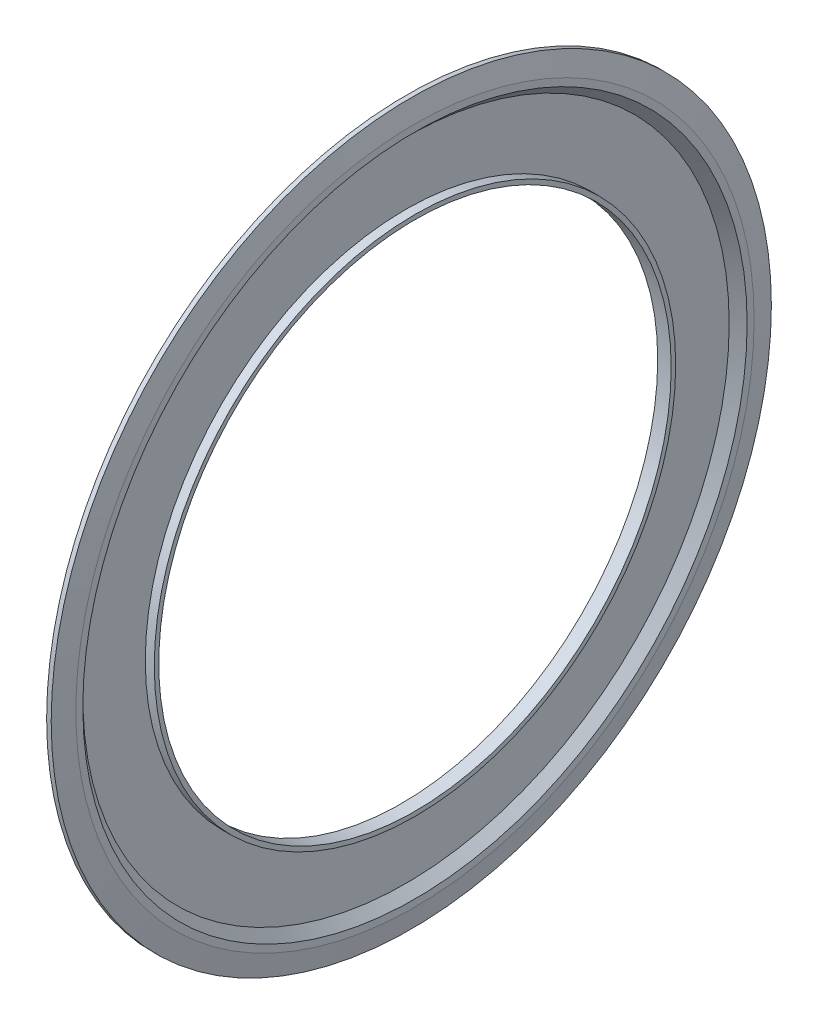
ISO-10303-21;
HEADER;
FILE_DESCRIPTION(('STEP AP214'),'2;1');
FILE_NAME('part.step','',(''),(''),'','','');
FILE_SCHEMA(('AUTOMOTIVE_DESIGN { 1 0 10303 214 1 1 1 1 }'));
ENDSEC;
DATA;
#1=APPLICATION_CONTEXT('core data for automotive mechanical design processes');
#2=APPLICATION_PROTOCOL_DEFINITION('international standard','automotive_design',2000,#1);
#3=PRODUCT_CONTEXT('',#1,'mechanical');
#4=PRODUCT('Part','Part','',(#3));
#5=PRODUCT_RELATED_PRODUCT_CATEGORY('part','',(#4));
#6=PRODUCT_DEFINITION_FORMATION('','',#4);
#7=PRODUCT_DEFINITION_CONTEXT('part definition',#1,'design');
#8=PRODUCT_DEFINITION('design','',#6,#7);
#9=PRODUCT_DEFINITION_SHAPE('','',#8);
#10=(LENGTH_UNIT() NAMED_UNIT(*) SI_UNIT(.MILLI.,.METRE.));
#11=(NAMED_UNIT(*) PLANE_ANGLE_UNIT() SI_UNIT($,.RADIAN.));
#12=(NAMED_UNIT(*) SI_UNIT($,.STERADIAN.) SOLID_ANGLE_UNIT());
#13=UNCERTAINTY_MEASURE_WITH_UNIT(LENGTH_MEASURE(1.E-05),#10,'distance_accuracy_value','');
#14=(GEOMETRIC_REPRESENTATION_CONTEXT(3) GLOBAL_UNCERTAINTY_ASSIGNED_CONTEXT((#13)) GLOBAL_UNIT_ASSIGNED_CONTEXT((#10,
#11,#12)) REPRESENTATION_CONTEXT('',''));
#15=CARTESIAN_POINT('',(0.,0.,0.));
#16=DIRECTION('',(0.,0.,1.));
#17=DIRECTION('',(1.,0.,0.));
#18=AXIS2_PLACEMENT_3D('',#15,#16,#17);
#19=CARTESIAN_POINT('',(0.352094453300078,0.,0.));
#20=DIRECTION('',(-1.,0.,0.));
#21=DIRECTION('',(0.,0.,1.));
#22=AXIS2_PLACEMENT_3D('',#19,#20,#21);
#23=CONICAL_SURFACE('',#22,6.8,1.39626340159546);
#24=CARTESIAN_POINT('',(0.278037121402523,0.,0.));
#25=DIRECTION('',(1.,0.,0.));
#26=DIRECTION('',(0.,0.,-1.));
#27=AXIS2_PLACEMENT_3D('',#24,#25,#26);
#28=CIRCLE('',#27,7.22);
#29=CARTESIAN_POINT('',(0.278037121402524,0.,-7.22));
#30=VERTEX_POINT('',#29);
#31=EDGE_CURVE('E71',#30,#30,#28,.T.);
#32=ORIENTED_EDGE('',*,*,#31,.T.);
#33=EDGE_LOOP('',(#32));
#34=FACE_BOUND('',#33,.T.);
#35=CARTESIAN_POINT('',(0.352094453300078,0.,0.));
#36=DIRECTION('',(1.,0.,0.));
#37=DIRECTION('',(0.,0.,-1.));
#38=AXIS2_PLACEMENT_3D('',#35,#36,#37);
#39=CIRCLE('',#38,6.8);
#40=CARTESIAN_POINT('',(0.352094453300079,0.,-6.8));
#41=VERTEX_POINT('',#40);
#42=EDGE_CURVE('E10',#41,#41,#39,.T.);
#43=ORIENTED_EDGE('',*,*,#42,.F.);
#44=EDGE_LOOP('',(#43));
#45=FACE_BOUND('',#44,.T.);
#46=ADVANCED_FACE('F14',(#34,#45),#23,.T.);
#47=CARTESIAN_POINT('',(0.352094453300078,6.8,0.));
#48=DIRECTION('',(-1.,0.,0.));
#49=DIRECTION('',(0.,0.,1.));
#50=AXIS2_PLACEMENT_3D('',#47,#48,#49);
#51=PLANE('',#50);
#52=CARTESIAN_POINT('',(0.352094453300078,0.,0.));
#53=DIRECTION('',(1.,0.,0.));
#54=DIRECTION('',(0.,0.,-1.));
#55=AXIS2_PLACEMENT_3D('',#52,#53,#54);
#56=CIRCLE('',#55,6.66);
#57=CARTESIAN_POINT('',(0.352094453300079,0.,-6.66));
#58=VERTEX_POINT('',#57);
#59=EDGE_CURVE('E21',#58,#58,#56,.T.);
#60=ORIENTED_EDGE('',*,*,#59,.F.);
#61=EDGE_LOOP('',(#60));
#62=FACE_BOUND('',#61,.T.);
#63=ORIENTED_EDGE('',*,*,#42,.T.);
#64=EDGE_LOOP('',(#63));
#65=FACE_BOUND('',#64,.T.);
#66=ADVANCED_FACE('F92',(#62,#65),#51,.F.);
#67=CARTESIAN_POINT('',(0.172094453300078,0.,0.));
#68=DIRECTION('',(1.,0.,0.));
#69=DIRECTION('',(0.,0.,-1.));
#70=AXIS2_PLACEMENT_3D('',#67,#68,#69);
#71=CONICAL_SURFACE('',#70,6.48,0.785398163397446);
#72=ORIENTED_EDGE('',*,*,#59,.T.);
#73=EDGE_LOOP('',(#72));
#74=FACE_BOUND('',#73,.T.);
#75=CARTESIAN_POINT('',(0.172094453300078,0.,0.));
#76=DIRECTION('',(1.,0.,0.));
#77=DIRECTION('',(0.,0.,-1.));
#78=AXIS2_PLACEMENT_3D('',#75,#76,#77);
#79=CIRCLE('',#78,6.48);
#80=CARTESIAN_POINT('',(0.172094453300079,0.,-6.48));
#81=VERTEX_POINT('',#80);
#82=EDGE_CURVE('E30',#81,#81,#79,.T.);
#83=ORIENTED_EDGE('',*,*,#82,.F.);
#84=EDGE_LOOP('',(#83));
#85=FACE_BOUND('',#84,.T.);
#86=ADVANCED_FACE('F96',(#74,#85),#71,.F.);
#87=CARTESIAN_POINT('',(0.172094453300078,5.2275,0.));
#88=DIRECTION('',(1.,0.,0.));
#89=DIRECTION('',(0.,0.,-1.));
#90=AXIS2_PLACEMENT_3D('',#87,#88,#89);
#91=PLANE('',#90);
#92=ORIENTED_EDGE('',*,*,#82,.T.);
#93=EDGE_LOOP('',(#92));
#94=FACE_BOUND('',#93,.T.);
#95=CARTESIAN_POINT('',(0.172094453300078,0.,0.));
#96=DIRECTION('',(1.,0.,0.));
#97=DIRECTION('',(0.,0.,-1.));
#98=AXIS2_PLACEMENT_3D('',#95,#96,#97);
#99=CIRCLE('',#98,5.2275);
#100=CARTESIAN_POINT('',(0.172094453300079,0.,-5.2275));
#101=VERTEX_POINT('',#100);
#102=EDGE_CURVE('E37',#101,#101,#99,.T.);
#103=ORIENTED_EDGE('',*,*,#102,.F.);
#104=EDGE_LOOP('',(#103));
#105=FACE_BOUND('',#104,.T.);
#106=ADVANCED_FACE('F101',(#94,#105),#91,.T.);
#107=CARTESIAN_POINT('',(0.352094453300078,0.,0.));
#108=DIRECTION('',(1.,0.,0.));
#109=DIRECTION('',(0.,0.,-1.));
#110=AXIS2_PLACEMENT_3D('',#107,#108,#109);
#111=CYLINDRICAL_SURFACE('',#110,5.2275);
#112=ORIENTED_EDGE('',*,*,#102,.T.);
#113=EDGE_LOOP('',(#112));
#114=FACE_BOUND('',#113,.T.);
#115=CARTESIAN_POINT('',(0.352094453300078,0.,0.));
#116=DIRECTION('',(1.,0.,0.));
#117=DIRECTION('',(0.,0.,-1.));
#118=AXIS2_PLACEMENT_3D('',#115,#116,#117);
#119=CIRCLE('',#118,5.2275);
#120=CARTESIAN_POINT('',(0.352094453300079,0.,-5.2275));
#121=VERTEX_POINT('',#120);
#122=EDGE_CURVE('E43',#121,#121,#119,.T.);
#123=ORIENTED_EDGE('',*,*,#122,.F.);
#124=EDGE_LOOP('',(#123));
#125=FACE_BOUND('',#124,.T.);
#126=ADVANCED_FACE('F106',(#114,#125),#111,.T.);
#127=CARTESIAN_POINT('',(0.352094453300078,5.1375,0.));
#128=DIRECTION('',(1.,0.,0.));
#129=DIRECTION('',(0.,0.,-1.));
#130=AXIS2_PLACEMENT_3D('',#127,#128,#129);
#131=PLANE('',#130);
#132=ORIENTED_EDGE('',*,*,#122,.T.);
#133=EDGE_LOOP('',(#132));
#134=FACE_BOUND('',#133,.T.);
#135=CARTESIAN_POINT('',(0.352094453300078,0.,0.));
#136=DIRECTION('',(1.,0.,0.));
#137=DIRECTION('',(0.,0.,-1.));
#138=AXIS2_PLACEMENT_3D('',#135,#136,#137);
#139=CIRCLE('',#138,5.1375);
#140=CARTESIAN_POINT('',(0.352094453300079,0.,-5.1375));
#141=VERTEX_POINT('',#140);
#142=EDGE_CURVE('E47',#141,#141,#139,.T.);
#143=ORIENTED_EDGE('',*,*,#142,.F.);
#144=EDGE_LOOP('',(#143));
#145=FACE_BOUND('',#144,.T.);
#146=ADVANCED_FACE('F110',(#134,#145),#131,.T.);
#147=CARTESIAN_POINT('',(0.352094453300078,0.,0.));
#148=DIRECTION('',(1.,0.,0.));
#149=DIRECTION('',(0.,0.,-1.));
#150=AXIS2_PLACEMENT_3D('',#147,#148,#149);
#151=CYLINDRICAL_SURFACE('',#150,5.1375);
#152=CARTESIAN_POINT('',(0.0820944533000784,0.,0.));
#153=DIRECTION('',(1.,0.,0.));
#154=DIRECTION('',(0.,0.,-1.));
#155=AXIS2_PLACEMENT_3D('',#152,#153,#154);
#156=CIRCLE('',#155,5.1375);
#157=CARTESIAN_POINT('',(0.082094453300079,0.,-5.1375));
#158=VERTEX_POINT('',#157);
#159=EDGE_CURVE('E51',#158,#158,#156,.T.);
#160=ORIENTED_EDGE('',*,*,#159,.F.);
#161=EDGE_LOOP('',(#160));
#162=FACE_BOUND('',#161,.T.);
#163=ORIENTED_EDGE('',*,*,#142,.T.);
#164=EDGE_LOOP('',(#163));
#165=FACE_BOUND('',#164,.T.);
#166=ADVANCED_FACE('F114',(#162,#165),#151,.F.);
#167=CARTESIAN_POINT('',(0.0820944533000784,5.1375,0.));
#168=DIRECTION('',(1.,0.,0.));
#169=DIRECTION('',(0.,0.,-1.));
#170=AXIS2_PLACEMENT_3D('',#167,#168,#169);
#171=PLANE('',#170);
#172=CARTESIAN_POINT('',(0.0820944533000784,0.,0.));
#173=DIRECTION('',(1.,0.,0.));
#174=DIRECTION('',(0.,0.,-1.));
#175=AXIS2_PLACEMENT_3D('',#172,#173,#174);
#176=CIRCLE('',#175,6.51727922061358);
#177=CARTESIAN_POINT('',(0.0820944533000792,0.,-6.51727922061358));
#178=VERTEX_POINT('',#177);
#179=EDGE_CURVE('E55',#178,#178,#176,.T.);
#180=ORIENTED_EDGE('',*,*,#179,.F.);
#181=EDGE_LOOP('',(#180));
#182=FACE_BOUND('',#181,.T.);
#183=ORIENTED_EDGE('',*,*,#159,.T.);
#184=EDGE_LOOP('',(#183));
#185=FACE_BOUND('',#184,.T.);
#186=ADVANCED_FACE('F118',(#182,#185),#171,.F.);
#187=CARTESIAN_POINT('',(0.0820944533000784,0.,0.));
#188=DIRECTION('',(1.,0.,0.));
#189=DIRECTION('',(0.,0.,-1.));
#190=AXIS2_PLACEMENT_3D('',#187,#188,#189);
#191=CONICAL_SURFACE('',#190,6.51727922061358,0.785398163397443);
#192=CARTESIAN_POINT('',(0.262094453300078,0.,0.));
#193=DIRECTION('',(1.,0.,0.));
#194=DIRECTION('',(0.,0.,-1.));
#195=AXIS2_PLACEMENT_3D('',#192,#193,#194);
#196=CIRCLE('',#195,6.69727922061358);
#197=CARTESIAN_POINT('',(0.262094453300079,0.,-6.69727922061358));
#198=VERTEX_POINT('',#197);
#199=EDGE_CURVE('E59',#198,#198,#196,.T.);
#200=ORIENTED_EDGE('',*,*,#199,.F.);
#201=EDGE_LOOP('',(#200));
#202=FACE_BOUND('',#201,.T.);
#203=ORIENTED_EDGE('',*,*,#179,.T.);
#204=EDGE_LOOP('',(#203));
#205=FACE_BOUND('',#204,.T.);
#206=ADVANCED_FACE('F122',(#202,#205),#191,.T.);
#207=CARTESIAN_POINT('',(0.262094453300078,6.69727922061358,0.));
#208=DIRECTION('',(1.,0.,0.));
#209=DIRECTION('',(0.,0.,-1.));
#210=AXIS2_PLACEMENT_3D('',#207,#208,#209);
#211=PLANE('',#210);
#212=CARTESIAN_POINT('',(0.262094453300078,0.,0.));
#213=DIRECTION('',(1.,0.,0.));
#214=DIRECTION('',(0.,0.,-1.));
#215=AXIS2_PLACEMENT_3D('',#212,#213,#214);
#216=CIRCLE('',#215,6.79212602028267);
#217=CARTESIAN_POINT('',(0.262094453300079,0.,-6.79212602028267));
#218=VERTEX_POINT('',#217);
#219=EDGE_CURVE('E63',#218,#218,#216,.T.);
#220=ORIENTED_EDGE('',*,*,#219,.F.);
#221=EDGE_LOOP('',(#220));
#222=FACE_BOUND('',#221,.T.);
#223=ORIENTED_EDGE('',*,*,#199,.T.);
#224=EDGE_LOOP('',(#223));
#225=FACE_BOUND('',#224,.T.);
#226=ADVANCED_FACE('F88',(#222,#225),#211,.F.);
#227=CARTESIAN_POINT('',(0.262094453300078,0.,0.));
#228=DIRECTION('',(-1.,0.,0.));
#229=DIRECTION('',(0.,0.,1.));
#230=AXIS2_PLACEMENT_3D('',#227,#228,#229);
#231=CONICAL_SURFACE('',#230,6.79212602028267,1.39626340159546);
#232=CARTESIAN_POINT('',(0.186648726332806,0.,0.));
#233=DIRECTION('',(1.,0.,0.));
#234=DIRECTION('',(0.,0.,-1.));
#235=AXIS2_PLACEMENT_3D('',#232,#233,#234);
#236=CIRCLE('',#235,7.22);
#237=CARTESIAN_POINT('',(0.186648726332807,0.,-7.22));
#238=VERTEX_POINT('',#237);
#239=EDGE_CURVE('E67',#238,#238,#236,.T.);
#240=ORIENTED_EDGE('',*,*,#239,.F.);
#241=EDGE_LOOP('',(#240));
#242=FACE_BOUND('',#241,.T.);
#243=ORIENTED_EDGE('',*,*,#219,.T.);
#244=EDGE_LOOP('',(#243));
#245=FACE_BOUND('',#244,.T.);
#246=ADVANCED_FACE('F81',(#242,#245),#231,.F.);
#247=CARTESIAN_POINT('',(0.352094453300078,0.,0.));
#248=DIRECTION('',(1.,0.,0.));
#249=DIRECTION('',(0.,0.,-1.));
#250=AXIS2_PLACEMENT_3D('',#247,#248,#249);
#251=CYLINDRICAL_SURFACE('',#250,7.22);
#252=ORIENTED_EDGE('',*,*,#239,.T.);
#253=EDGE_LOOP('',(#252));
#254=FACE_BOUND('',#253,.T.);
#255=ORIENTED_EDGE('',*,*,#31,.F.);
#256=EDGE_LOOP('',(#255));
#257=FACE_BOUND('',#256,.T.);
#258=ADVANCED_FACE('F79',(#254,#257),#251,.T.);
#259=CLOSED_SHELL('',(#46,#66,#86,#106,#126,#146,#166,#186,#206,#226,#246,#258));
#260=MANIFOLD_SOLID_BREP('B1',#259);
#261=ADVANCED_BREP_SHAPE_REPRESENTATION('',(#18,#260),#14);
#262=SHAPE_DEFINITION_REPRESENTATION(#9,#261);
ENDSEC;
END-ISO-10303-21;
